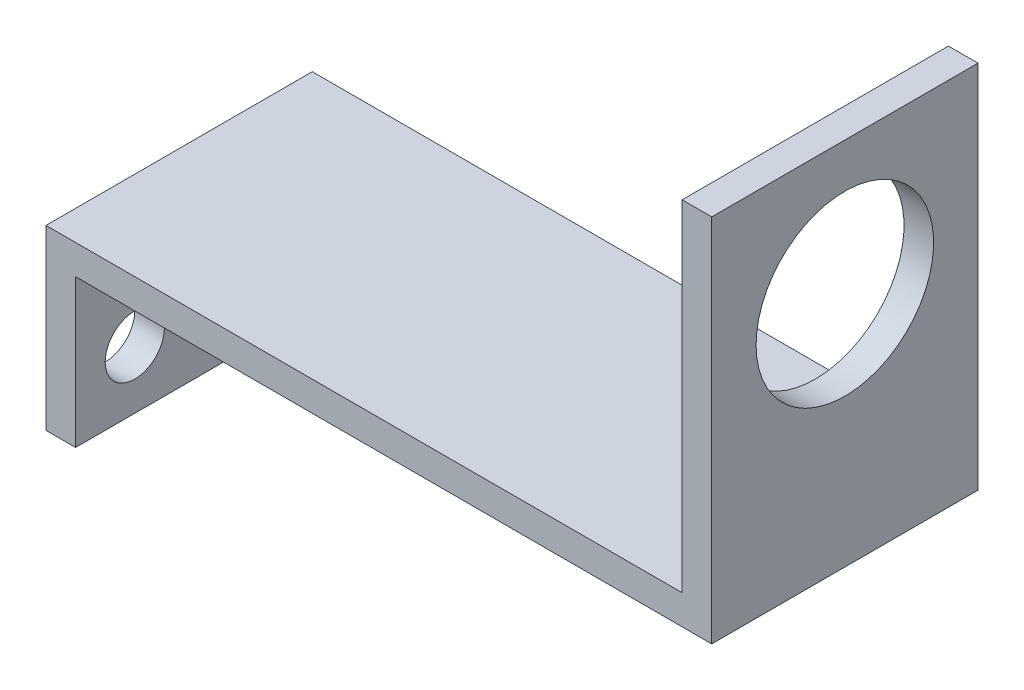
ISO-10303-21;
HEADER;
FILE_DESCRIPTION(('STEP AP214'),'2;1');
FILE_NAME('part.step','',(''),(''),'','','');
FILE_SCHEMA(('AUTOMOTIVE_DESIGN { 1 0 10303 214 1 1 1 1 }'));
ENDSEC;
DATA;
#1=APPLICATION_CONTEXT('core data for automotive mechanical design processes');
#2=APPLICATION_PROTOCOL_DEFINITION('international standard','automotive_design',2000,#1);
#3=PRODUCT_CONTEXT('',#1,'mechanical');
#4=PRODUCT('Part','Part','',(#3));
#5=PRODUCT_RELATED_PRODUCT_CATEGORY('part','',(#4));
#6=PRODUCT_DEFINITION_FORMATION('','',#4);
#7=PRODUCT_DEFINITION_CONTEXT('part definition',#1,'design');
#8=PRODUCT_DEFINITION('design','',#6,#7);
#9=PRODUCT_DEFINITION_SHAPE('','',#8);
#10=(LENGTH_UNIT() NAMED_UNIT(*) SI_UNIT(.MILLI.,.METRE.));
#11=(NAMED_UNIT(*) PLANE_ANGLE_UNIT() SI_UNIT($,.RADIAN.));
#12=(NAMED_UNIT(*) SI_UNIT($,.STERADIAN.) SOLID_ANGLE_UNIT());
#13=UNCERTAINTY_MEASURE_WITH_UNIT(LENGTH_MEASURE(1.E-05),#10,'distance_accuracy_value','');
#14=(GEOMETRIC_REPRESENTATION_CONTEXT(3) GLOBAL_UNCERTAINTY_ASSIGNED_CONTEXT((#13)) GLOBAL_UNIT_ASSIGNED_CONTEXT((#10,
#11,#12)) REPRESENTATION_CONTEXT('',''));
#15=CARTESIAN_POINT('',(0.,0.,0.));
#16=DIRECTION('',(0.,0.,1.));
#17=DIRECTION('',(1.,0.,0.));
#18=AXIS2_PLACEMENT_3D('',#15,#16,#17);
#19=CARTESIAN_POINT('',(2.,0.,18.));
#20=DIRECTION('',(0.,1.,0.));
#21=DIRECTION('',(-1.,0.,0.));
#22=AXIS2_PLACEMENT_3D('',#19,#20,#21);
#23=PLANE('',#22);
#24=DIRECTION('',(1.,0.,0.));
#25=VECTOR('',#24,1.);
#26=CARTESIAN_POINT('',(2.,0.,0.));
#27=LINE('',#26,#25);
#28=CARTESIAN_POINT('',(0.,0.,0.));
#29=VERTEX_POINT('',#28);
#30=CARTESIAN_POINT('',(2.,0.,0.));
#31=VERTEX_POINT('',#30);
#32=EDGE_CURVE('E129',#29,#31,#27,.T.);
#33=ORIENTED_EDGE('',*,*,#32,.T.);
#34=DIRECTION('',(0.,0.,-1.));
#35=VECTOR('',#34,1.);
#36=CARTESIAN_POINT('',(2.,0.,18.));
#37=LINE('',#36,#35);
#38=CARTESIAN_POINT('',(2.,0.,18.));
#39=VERTEX_POINT('',#38);
#40=EDGE_CURVE('E11',#39,#31,#37,.T.);
#41=ORIENTED_EDGE('',*,*,#40,.F.);
#42=DIRECTION('',(1.,0.,0.));
#43=VECTOR('',#42,1.);
#44=CARTESIAN_POINT('',(2.,0.,18.));
#45=LINE('',#44,#43);
#46=CARTESIAN_POINT('',(0.,0.,18.));
#47=VERTEX_POINT('',#46);
#48=EDGE_CURVE('E144',#47,#39,#45,.T.);
#49=ORIENTED_EDGE('',*,*,#48,.F.);
#50=DIRECTION('',(0.,0.,-1.));
#51=VECTOR('',#50,1.);
#52=CARTESIAN_POINT('',(0.,0.,18.));
#53=LINE('',#52,#51);
#54=EDGE_CURVE('E125',#47,#29,#53,.T.);
#55=ORIENTED_EDGE('',*,*,#54,.T.);
#56=EDGE_LOOP('',(#33,#41,#49,#55));
#57=FACE_BOUND('',#56,.T.);
#58=ADVANCED_FACE('F33',(#57),#23,.F.);
#59=CARTESIAN_POINT('',(2.,9.99999999999999,18.));
#60=DIRECTION('',(-1.,0.,0.));
#61=DIRECTION('',(0.,-1.,0.));
#62=AXIS2_PLACEMENT_3D('',#59,#60,#61);
#63=PLANE('',#62);
#64=CARTESIAN_POINT('',(2.,4.,4.));
#65=DIRECTION('',(-1.,0.,0.));
#66=DIRECTION('',(0.,-1.,0.));
#67=AXIS2_PLACEMENT_3D('',#64,#65,#66);
#68=CIRCLE('',#67,2.);
#69=CARTESIAN_POINT('',(2.,2.,4.));
#70=VERTEX_POINT('',#69);
#71=EDGE_CURVE('E133',#70,#70,#68,.F.);
#72=ORIENTED_EDGE('',*,*,#71,.F.);
#73=EDGE_LOOP('',(#72));
#74=FACE_BOUND('',#73,.T.);
#75=CARTESIAN_POINT('',(2.,4.,14.));
#76=DIRECTION('',(-1.,0.,0.));
#77=DIRECTION('',(0.,-1.,0.));
#78=AXIS2_PLACEMENT_3D('',#75,#76,#77);
#79=CIRCLE('',#78,2.);
#80=CARTESIAN_POINT('',(2.,2.,14.));
#81=VERTEX_POINT('',#80);
#82=EDGE_CURVE('E177',#81,#81,#79,.F.);
#83=ORIENTED_EDGE('',*,*,#82,.F.);
#84=EDGE_LOOP('',(#83));
#85=FACE_BOUND('',#84,.T.);
#86=DIRECTION('',(0.,1.,0.));
#87=VECTOR('',#86,1.);
#88=CARTESIAN_POINT('',(2.,9.99999999999999,0.));
#89=LINE('',#88,#87);
#90=CARTESIAN_POINT('',(2.,9.99999999999999,0.));
#91=VERTEX_POINT('',#90);
#92=EDGE_CURVE('E132',#31,#91,#89,.T.);
#93=ORIENTED_EDGE('',*,*,#92,.T.);
#94=DIRECTION('',(0.,0.,-1.));
#95=VECTOR('',#94,1.);
#96=CARTESIAN_POINT('',(2.,9.99999999999999,18.));
#97=LINE('',#96,#95);
#98=CARTESIAN_POINT('',(2.,9.99999999999999,18.));
#99=VERTEX_POINT('',#98);
#100=EDGE_CURVE('E41',#99,#91,#97,.T.);
#101=ORIENTED_EDGE('',*,*,#100,.F.);
#102=DIRECTION('',(0.,1.,0.));
#103=VECTOR('',#102,1.);
#104=CARTESIAN_POINT('',(2.,9.99999999999999,18.));
#105=LINE('',#104,#103);
#106=EDGE_CURVE('E92',#39,#99,#105,.T.);
#107=ORIENTED_EDGE('',*,*,#106,.F.);
#108=ORIENTED_EDGE('',*,*,#40,.T.);
#109=EDGE_LOOP('',(#93,#101,#107,#108));
#110=FACE_BOUND('',#109,.T.);
#111=ADVANCED_FACE('F208',(#74,#85,#110),#63,.F.);
#112=CARTESIAN_POINT('',(45.,10.,18.));
#113=DIRECTION('',(0.,1.,0.));
#114=DIRECTION('',(-1.,0.,0.));
#115=AXIS2_PLACEMENT_3D('',#112,#113,#114);
#116=PLANE('',#115);
#117=DIRECTION('',(1.,0.,0.));
#118=VECTOR('',#117,1.);
#119=CARTESIAN_POINT('',(45.,10.,0.));
#120=LINE('',#119,#118);
#121=CARTESIAN_POINT('',(45.,10.,0.));
#122=VERTEX_POINT('',#121);
#123=EDGE_CURVE('E135',#91,#122,#120,.T.);
#124=ORIENTED_EDGE('',*,*,#123,.T.);
#125=DIRECTION('',(0.,0.,-1.));
#126=VECTOR('',#125,1.);
#127=CARTESIAN_POINT('',(45.,10.,18.));
#128=LINE('',#127,#126);
#129=CARTESIAN_POINT('',(45.,10.,18.));
#130=VERTEX_POINT('',#129);
#131=EDGE_CURVE('E151',#130,#122,#128,.T.);
#132=ORIENTED_EDGE('',*,*,#131,.F.);
#133=DIRECTION('',(1.,0.,0.));
#134=VECTOR('',#133,1.);
#135=CARTESIAN_POINT('',(45.,10.,18.));
#136=LINE('',#135,#134);
#137=EDGE_CURVE('E159',#99,#130,#136,.T.);
#138=ORIENTED_EDGE('',*,*,#137,.F.);
#139=ORIENTED_EDGE('',*,*,#100,.T.);
#140=EDGE_LOOP('',(#124,#132,#138,#139));
#141=FACE_BOUND('',#140,.T.);
#142=ADVANCED_FACE('F157',(#141),#116,.F.);
#143=CARTESIAN_POINT('',(45.,35.,18.));
#144=DIRECTION('',(-1.,0.,0.));
#145=DIRECTION('',(0.,0.,1.));
#146=AXIS2_PLACEMENT_3D('',#143,#144,#145);
#147=PLANE('',#146);
#148=CARTESIAN_POINT('',(45.,26.,9.));
#149=DIRECTION('',(-1.,0.,0.));
#150=DIRECTION('',(0.,0.,1.));
#151=AXIS2_PLACEMENT_3D('',#148,#149,#150);
#152=CIRCLE('',#151,6.);
#153=CARTESIAN_POINT('',(45.,26.,15.));
#154=VERTEX_POINT('',#153);
#155=EDGE_CURVE('E184',#154,#154,#152,.F.);
#156=ORIENTED_EDGE('',*,*,#155,.F.);
#157=EDGE_LOOP('',(#156));
#158=FACE_BOUND('',#157,.T.);
#159=DIRECTION('',(0.,1.,0.));
#160=VECTOR('',#159,1.);
#161=CARTESIAN_POINT('',(45.,35.,0.));
#162=LINE('',#161,#160);
#163=CARTESIAN_POINT('',(45.,35.,0.));
#164=VERTEX_POINT('',#163);
#165=EDGE_CURVE('E137',#122,#164,#162,.T.);
#166=ORIENTED_EDGE('',*,*,#165,.T.);
#167=DIRECTION('',(0.,0.,-1.));
#168=VECTOR('',#167,1.);
#169=CARTESIAN_POINT('',(45.,35.,18.));
#170=LINE('',#169,#168);
#171=CARTESIAN_POINT('',(45.,35.,18.));
#172=VERTEX_POINT('',#171);
#173=EDGE_CURVE('E148',#172,#164,#170,.T.);
#174=ORIENTED_EDGE('',*,*,#173,.F.);
#175=DIRECTION('',(0.,1.,0.));
#176=VECTOR('',#175,1.);
#177=CARTESIAN_POINT('',(45.,35.,18.));
#178=LINE('',#177,#176);
#179=EDGE_CURVE('E171',#130,#172,#178,.T.);
#180=ORIENTED_EDGE('',*,*,#179,.F.);
#181=ORIENTED_EDGE('',*,*,#131,.T.);
#182=EDGE_LOOP('',(#166,#174,#180,#181));
#183=FACE_BOUND('',#182,.T.);
#184=ADVANCED_FACE('F167',(#158,#183),#147,.F.);
#185=CARTESIAN_POINT('',(43.,35.,18.));
#186=DIRECTION('',(0.,-1.,0.));
#187=DIRECTION('',(0.,0.,-1.));
#188=AXIS2_PLACEMENT_3D('',#185,#186,#187);
#189=PLANE('',#188);
#190=DIRECTION('',(-1.,0.,0.));
#191=VECTOR('',#190,1.);
#192=CARTESIAN_POINT('',(43.,35.,0.));
#193=LINE('',#192,#191);
#194=CARTESIAN_POINT('',(43.,35.,0.));
#195=VERTEX_POINT('',#194);
#196=EDGE_CURVE('E139',#164,#195,#193,.T.);
#197=ORIENTED_EDGE('',*,*,#196,.T.);
#198=DIRECTION('',(0.,0.,-1.));
#199=VECTOR('',#198,1.);
#200=CARTESIAN_POINT('',(43.,35.,18.));
#201=LINE('',#200,#199);
#202=CARTESIAN_POINT('',(43.,35.,18.));
#203=VERTEX_POINT('',#202);
#204=EDGE_CURVE('E120',#203,#195,#201,.T.);
#205=ORIENTED_EDGE('',*,*,#204,.F.);
#206=DIRECTION('',(-1.,0.,0.));
#207=VECTOR('',#206,1.);
#208=CARTESIAN_POINT('',(43.,35.,18.));
#209=LINE('',#208,#207);
#210=EDGE_CURVE('E111',#172,#203,#209,.T.);
#211=ORIENTED_EDGE('',*,*,#210,.F.);
#212=ORIENTED_EDGE('',*,*,#173,.T.);
#213=EDGE_LOOP('',(#197,#205,#211,#212));
#214=FACE_BOUND('',#213,.T.);
#215=ADVANCED_FACE('F170',(#214),#189,.F.);
#216=CARTESIAN_POINT('',(43.,12.,18.));
#217=DIRECTION('',(1.,0.,0.));
#218=DIRECTION('',(0.,0.,-1.));
#219=AXIS2_PLACEMENT_3D('',#216,#217,#218);
#220=PLANE('',#219);
#221=CARTESIAN_POINT('',(43.,26.,9.));
#222=DIRECTION('',(-1.,0.,0.));
#223=DIRECTION('',(0.,0.,1.));
#224=AXIS2_PLACEMENT_3D('',#221,#222,#223);
#225=CIRCLE('',#224,6.);
#226=CARTESIAN_POINT('',(43.,26.,15.));
#227=VERTEX_POINT('',#226);
#228=EDGE_CURVE('E191',#227,#227,#225,.T.);
#229=ORIENTED_EDGE('',*,*,#228,.F.);
#230=EDGE_LOOP('',(#229));
#231=FACE_BOUND('',#230,.T.);
#232=DIRECTION('',(0.,-1.,0.));
#233=VECTOR('',#232,1.);
#234=CARTESIAN_POINT('',(43.,12.,0.));
#235=LINE('',#234,#233);
#236=CARTESIAN_POINT('',(43.,12.,0.));
#237=VERTEX_POINT('',#236);
#238=EDGE_CURVE('E119',#195,#237,#235,.T.);
#239=ORIENTED_EDGE('',*,*,#238,.T.);
#240=DIRECTION('',(0.,0.,-1.));
#241=VECTOR('',#240,1.);
#242=CARTESIAN_POINT('',(43.,12.,18.));
#243=LINE('',#242,#241);
#244=CARTESIAN_POINT('',(43.,12.,18.));
#245=VERTEX_POINT('',#244);
#246=EDGE_CURVE('E116',#245,#237,#243,.T.);
#247=ORIENTED_EDGE('',*,*,#246,.F.);
#248=DIRECTION('',(0.,-1.,0.));
#249=VECTOR('',#248,1.);
#250=CARTESIAN_POINT('',(43.,12.,18.));
#251=LINE('',#250,#249);
#252=EDGE_CURVE('E105',#203,#245,#251,.T.);
#253=ORIENTED_EDGE('',*,*,#252,.F.);
#254=ORIENTED_EDGE('',*,*,#204,.T.);
#255=EDGE_LOOP('',(#239,#247,#253,#254));
#256=FACE_BOUND('',#255,.T.);
#257=ADVANCED_FACE('F117',(#231,#256),#220,.F.);
#258=CARTESIAN_POINT('',(0.,12.,18.));
#259=DIRECTION('',(0.,-1.,0.));
#260=DIRECTION('',(0.,0.,-1.));
#261=AXIS2_PLACEMENT_3D('',#258,#259,#260);
#262=PLANE('',#261);
#263=DIRECTION('',(-1.,0.,0.));
#264=VECTOR('',#263,1.);
#265=CARTESIAN_POINT('',(0.,12.,0.));
#266=LINE('',#265,#264);
#267=CARTESIAN_POINT('',(0.,12.,0.));
#268=VERTEX_POINT('',#267);
#269=EDGE_CURVE('E78',#237,#268,#266,.T.);
#270=ORIENTED_EDGE('',*,*,#269,.T.);
#271=DIRECTION('',(0.,0.,-1.));
#272=VECTOR('',#271,1.);
#273=CARTESIAN_POINT('',(0.,12.,18.));
#274=LINE('',#273,#272);
#275=CARTESIAN_POINT('',(0.,12.,18.));
#276=VERTEX_POINT('',#275);
#277=EDGE_CURVE('E121',#276,#268,#274,.T.);
#278=ORIENTED_EDGE('',*,*,#277,.F.);
#279=DIRECTION('',(-1.,0.,0.));
#280=VECTOR('',#279,1.);
#281=CARTESIAN_POINT('',(0.,12.,18.));
#282=LINE('',#281,#280);
#283=EDGE_CURVE('E109',#245,#276,#282,.T.);
#284=ORIENTED_EDGE('',*,*,#283,.F.);
#285=ORIENTED_EDGE('',*,*,#246,.T.);
#286=EDGE_LOOP('',(#270,#278,#284,#285));
#287=FACE_BOUND('',#286,.T.);
#288=ADVANCED_FACE('F123',(#287),#262,.F.);
#289=CARTESIAN_POINT('',(0.,0.,18.));
#290=DIRECTION('',(1.,0.,0.));
#291=DIRECTION('',(0.,0.,-1.));
#292=AXIS2_PLACEMENT_3D('',#289,#290,#291);
#293=PLANE('',#292);
#294=CARTESIAN_POINT('',(0.,4.,4.));
#295=DIRECTION('',(-1.,0.,0.));
#296=DIRECTION('',(0.,0.,1.));
#297=AXIS2_PLACEMENT_3D('',#294,#295,#296);
#298=CIRCLE('',#297,2.);
#299=CARTESIAN_POINT('',(0.,4.,6.));
#300=VERTEX_POINT('',#299);
#301=EDGE_CURVE('E180',#300,#300,#298,.T.);
#302=ORIENTED_EDGE('',*,*,#301,.F.);
#303=EDGE_LOOP('',(#302));
#304=FACE_BOUND('',#303,.T.);
#305=CARTESIAN_POINT('',(0.,4.,14.));
#306=DIRECTION('',(-1.,0.,0.));
#307=DIRECTION('',(0.,0.,1.));
#308=AXIS2_PLACEMENT_3D('',#305,#306,#307);
#309=CIRCLE('',#308,2.);
#310=CARTESIAN_POINT('',(0.,4.,16.));
#311=VERTEX_POINT('',#310);
#312=EDGE_CURVE('E181',#311,#311,#309,.T.);
#313=ORIENTED_EDGE('',*,*,#312,.F.);
#314=EDGE_LOOP('',(#313));
#315=FACE_BOUND('',#314,.T.);
#316=DIRECTION('',(0.,-1.,0.));
#317=VECTOR('',#316,1.);
#318=CARTESIAN_POINT('',(0.,0.,0.));
#319=LINE('',#318,#317);
#320=EDGE_CURVE('E84',#268,#29,#319,.T.);
#321=ORIENTED_EDGE('',*,*,#320,.T.);
#322=ORIENTED_EDGE('',*,*,#54,.F.);
#323=DIRECTION('',(0.,-1.,0.));
#324=VECTOR('',#323,1.);
#325=CARTESIAN_POINT('',(0.,0.,18.));
#326=LINE('',#325,#324);
#327=EDGE_CURVE('E49',#276,#47,#326,.T.);
#328=ORIENTED_EDGE('',*,*,#327,.F.);
#329=ORIENTED_EDGE('',*,*,#277,.T.);
#330=EDGE_LOOP('',(#321,#322,#328,#329));
#331=FACE_BOUND('',#330,.T.);
#332=ADVANCED_FACE('F204',(#304,#315,#331),#293,.F.);
#333=CARTESIAN_POINT('',(0.,0.,18.));
#334=DIRECTION('',(0.,0.,-1.));
#335=DIRECTION('',(-1.,0.,0.));
#336=AXIS2_PLACEMENT_3D('',#333,#334,#335);
#337=PLANE('',#336);
#338=ORIENTED_EDGE('',*,*,#48,.T.);
#339=ORIENTED_EDGE('',*,*,#106,.T.);
#340=ORIENTED_EDGE('',*,*,#137,.T.);
#341=ORIENTED_EDGE('',*,*,#179,.T.);
#342=ORIENTED_EDGE('',*,*,#210,.T.);
#343=ORIENTED_EDGE('',*,*,#252,.T.);
#344=ORIENTED_EDGE('',*,*,#283,.T.);
#345=ORIENTED_EDGE('',*,*,#327,.T.);
#346=EDGE_LOOP('',(#338,#339,#340,#341,#342,#343,#344,#345));
#347=FACE_BOUND('',#346,.T.);
#348=ADVANCED_FACE('F107',(#347),#337,.F.);
#349=CARTESIAN_POINT('',(0.,0.,0.));
#350=DIRECTION('',(0.,0.,-1.));
#351=DIRECTION('',(-1.,0.,0.));
#352=AXIS2_PLACEMENT_3D('',#349,#350,#351);
#353=PLANE('',#352);
#354=ORIENTED_EDGE('',*,*,#32,.F.);
#355=ORIENTED_EDGE('',*,*,#320,.F.);
#356=ORIENTED_EDGE('',*,*,#269,.F.);
#357=ORIENTED_EDGE('',*,*,#238,.F.);
#358=ORIENTED_EDGE('',*,*,#196,.F.);
#359=ORIENTED_EDGE('',*,*,#165,.F.);
#360=ORIENTED_EDGE('',*,*,#123,.F.);
#361=ORIENTED_EDGE('',*,*,#92,.F.);
#362=EDGE_LOOP('',(#354,#355,#356,#357,#358,#359,#360,#361));
#363=FACE_BOUND('',#362,.T.);
#364=ADVANCED_FACE('F163',(#363),#353,.T.);
#365=CARTESIAN_POINT('',(45.001,4.,14.));
#366=DIRECTION('',(-1.,0.,0.));
#367=DIRECTION('',(0.,0.,1.));
#368=AXIS2_PLACEMENT_3D('',#365,#366,#367);
#369=CYLINDRICAL_SURFACE('',#368,2.);
#370=ORIENTED_EDGE('',*,*,#312,.T.);
#371=EDGE_LOOP('',(#370));
#372=FACE_BOUND('',#371,.T.);
#373=ORIENTED_EDGE('',*,*,#82,.T.);
#374=EDGE_LOOP('',(#373));
#375=FACE_BOUND('',#374,.T.);
#376=ADVANCED_FACE('F227',(#372,#375),#369,.F.);
#377=CARTESIAN_POINT('',(45.001,4.,4.));
#378=DIRECTION('',(-1.,0.,0.));
#379=DIRECTION('',(0.,0.,1.));
#380=AXIS2_PLACEMENT_3D('',#377,#378,#379);
#381=CYLINDRICAL_SURFACE('',#380,2.);
#382=ORIENTED_EDGE('',*,*,#301,.T.);
#383=EDGE_LOOP('',(#382));
#384=FACE_BOUND('',#383,.T.);
#385=ORIENTED_EDGE('',*,*,#71,.T.);
#386=EDGE_LOOP('',(#385));
#387=FACE_BOUND('',#386,.T.);
#388=ADVANCED_FACE('F231',(#384,#387),#381,.F.);
#389=CARTESIAN_POINT('',(45.001,26.,9.));
#390=DIRECTION('',(-1.,0.,0.));
#391=DIRECTION('',(0.,0.,1.));
#392=AXIS2_PLACEMENT_3D('',#389,#390,#391);
#393=CYLINDRICAL_SURFACE('',#392,6.);
#394=ORIENTED_EDGE('',*,*,#228,.T.);
#395=EDGE_LOOP('',(#394));
#396=FACE_BOUND('',#395,.T.);
#397=ORIENTED_EDGE('',*,*,#155,.T.);
#398=EDGE_LOOP('',(#397));
#399=FACE_BOUND('',#398,.T.);
#400=ADVANCED_FACE('F195',(#396,#399),#393,.F.);
#401=CLOSED_SHELL('',(#58,#111,#142,#184,#215,#257,#288,#332,#348,#364,#376,#388,#400));
#402=MANIFOLD_SOLID_BREP('B2',#401);
#403=ADVANCED_BREP_SHAPE_REPRESENTATION('',(#18,#402),#14);
#404=SHAPE_DEFINITION_REPRESENTATION(#9,#403);
ENDSEC;
END-ISO-10303-21;
